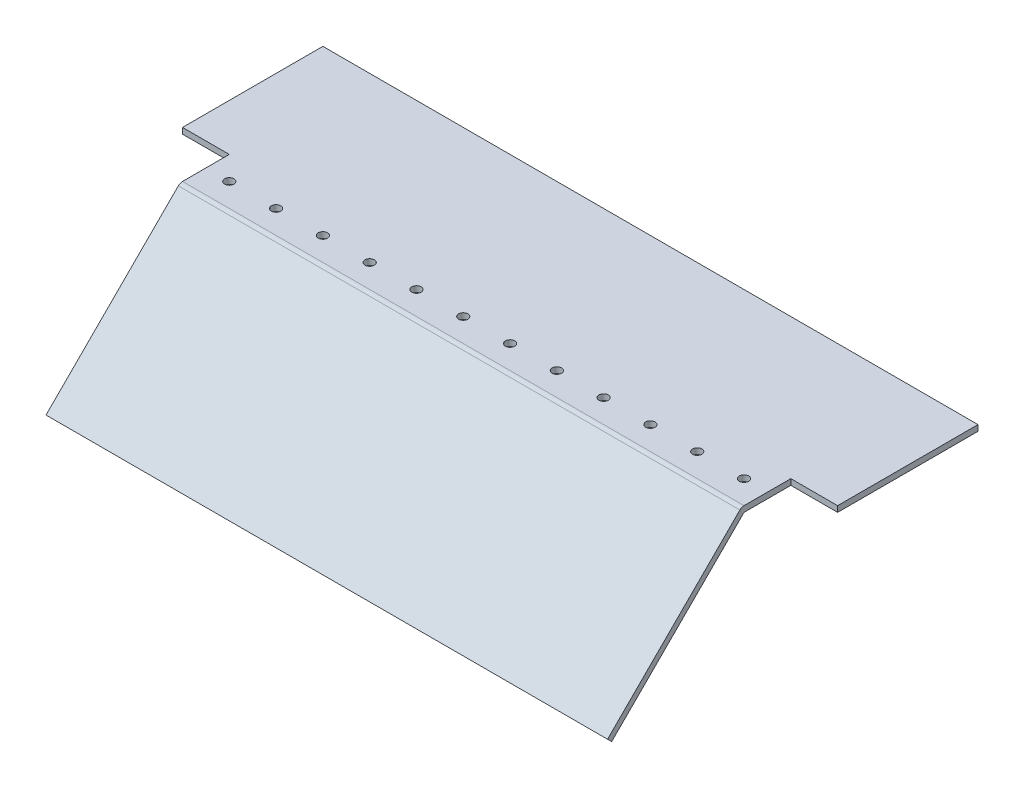
ISO-10303-21;
HEADER;
FILE_DESCRIPTION(('STEP AP214'),'2;1');
FILE_NAME('part.step','',(''),(''),'','','');
FILE_SCHEMA(('AUTOMOTIVE_DESIGN { 1 0 10303 214 1 1 1 1 }'));
ENDSEC;
DATA;
#1=APPLICATION_CONTEXT('core data for automotive mechanical design processes');
#2=APPLICATION_PROTOCOL_DEFINITION('international standard','automotive_design',2000,#1);
#3=PRODUCT_CONTEXT('',#1,'mechanical');
#4=PRODUCT('Part','Part','',(#3));
#5=PRODUCT_RELATED_PRODUCT_CATEGORY('part','',(#4));
#6=PRODUCT_DEFINITION_FORMATION('','',#4);
#7=PRODUCT_DEFINITION_CONTEXT('part definition',#1,'design');
#8=PRODUCT_DEFINITION('design','',#6,#7);
#9=PRODUCT_DEFINITION_SHAPE('','',#8);
#10=(LENGTH_UNIT() NAMED_UNIT(*) SI_UNIT(.MILLI.,.METRE.));
#11=(NAMED_UNIT(*) PLANE_ANGLE_UNIT() SI_UNIT($,.RADIAN.));
#12=(NAMED_UNIT(*) SI_UNIT($,.STERADIAN.) SOLID_ANGLE_UNIT());
#13=UNCERTAINTY_MEASURE_WITH_UNIT(LENGTH_MEASURE(1.E-05),#10,'distance_accuracy_value','');
#14=(GEOMETRIC_REPRESENTATION_CONTEXT(3) GLOBAL_UNCERTAINTY_ASSIGNED_CONTEXT((#13)) GLOBAL_UNIT_ASSIGNED_CONTEXT((#10,
#11,#12)) REPRESENTATION_CONTEXT('',''));
#15=CARTESIAN_POINT('',(0.,0.,0.));
#16=DIRECTION('',(0.,0.,1.));
#17=DIRECTION('',(1.,0.,0.));
#18=AXIS2_PLACEMENT_3D('',#15,#16,#17);
#19=CARTESIAN_POINT('',(139.7,-71.8420489685529,-12.7));
#20=DIRECTION('',(0.,1.,0.));
#21=DIRECTION('',(0.,0.,1.));
#22=AXIS2_PLACEMENT_3D('',#19,#20,#21);
#23=CYLINDRICAL_SURFACE('',#22,2.54000000000001);
#24=CARTESIAN_POINT('',(139.7,3.175,-12.7));
#25=DIRECTION('',(0.,1.,0.));
#26=DIRECTION('',(0.,0.,1.));
#27=AXIS2_PLACEMENT_3D('',#24,#25,#26);
#28=CIRCLE('',#27,2.54000000000001);
#29=CARTESIAN_POINT('',(139.7,3.175,-10.16));
#30=VERTEX_POINT('',#29);
#31=EDGE_CURVE('E50',#30,#30,#28,.T.);
#32=ORIENTED_EDGE('',*,*,#31,.T.);
#33=EDGE_LOOP('',(#32));
#34=FACE_BOUND('',#33,.T.);
#35=CARTESIAN_POINT('',(139.7,0.,-12.7));
#36=DIRECTION('',(0.,1.,0.));
#37=DIRECTION('',(0.,0.,1.));
#38=AXIS2_PLACEMENT_3D('',#35,#36,#37);
#39=CIRCLE('',#38,2.54000000000001);
#40=CARTESIAN_POINT('',(139.7,0.,-10.16));
#41=VERTEX_POINT('',#40);
#42=EDGE_CURVE('E11',#41,#41,#39,.T.);
#43=ORIENTED_EDGE('',*,*,#42,.F.);
#44=EDGE_LOOP('',(#43));
#45=FACE_BOUND('',#44,.T.);
#46=ADVANCED_FACE('F37',(#34,#45),#23,.F.);
#47=CARTESIAN_POINT('',(114.3,-71.8420489685529,-12.7));
#48=DIRECTION('',(0.,1.,0.));
#49=DIRECTION('',(0.,0.,1.));
#50=AXIS2_PLACEMENT_3D('',#47,#48,#49);
#51=CYLINDRICAL_SURFACE('',#50,2.54000000000001);
#52=CARTESIAN_POINT('',(114.3,3.175,-12.7));
#53=DIRECTION('',(0.,1.,0.));
#54=DIRECTION('',(0.,0.,1.));
#55=AXIS2_PLACEMENT_3D('',#52,#53,#54);
#56=CIRCLE('',#55,2.54000000000001);
#57=CARTESIAN_POINT('',(114.3,3.175,-10.16));
#58=VERTEX_POINT('',#57);
#59=EDGE_CURVE('E267',#58,#58,#56,.T.);
#60=ORIENTED_EDGE('',*,*,#59,.T.);
#61=EDGE_LOOP('',(#60));
#62=FACE_BOUND('',#61,.T.);
#63=CARTESIAN_POINT('',(114.3,0.,-12.7));
#64=DIRECTION('',(0.,1.,0.));
#65=DIRECTION('',(0.,0.,1.));
#66=AXIS2_PLACEMENT_3D('',#63,#64,#65);
#67=CIRCLE('',#66,2.54000000000001);
#68=CARTESIAN_POINT('',(114.3,0.,-10.16));
#69=VERTEX_POINT('',#68);
#70=EDGE_CURVE('E275',#69,#69,#67,.T.);
#71=ORIENTED_EDGE('',*,*,#70,.F.);
#72=EDGE_LOOP('',(#71));
#73=FACE_BOUND('',#72,.T.);
#74=ADVANCED_FACE('F296',(#62,#73),#51,.F.);
#75=CARTESIAN_POINT('',(88.9,-71.8420489685529,-12.7));
#76=DIRECTION('',(0.,1.,0.));
#77=DIRECTION('',(0.,0.,1.));
#78=AXIS2_PLACEMENT_3D('',#75,#76,#77);
#79=CYLINDRICAL_SURFACE('',#78,2.54000000000001);
#80=CARTESIAN_POINT('',(88.9,3.175,-12.7));
#81=DIRECTION('',(0.,1.,0.));
#82=DIRECTION('',(0.,0.,1.));
#83=AXIS2_PLACEMENT_3D('',#80,#81,#82);
#84=CIRCLE('',#83,2.54000000000001);
#85=CARTESIAN_POINT('',(88.9,3.175,-10.16));
#86=VERTEX_POINT('',#85);
#87=EDGE_CURVE('E263',#86,#86,#84,.T.);
#88=ORIENTED_EDGE('',*,*,#87,.T.);
#89=EDGE_LOOP('',(#88));
#90=FACE_BOUND('',#89,.T.);
#91=CARTESIAN_POINT('',(88.9,0.,-12.7));
#92=DIRECTION('',(0.,1.,0.));
#93=DIRECTION('',(0.,0.,1.));
#94=AXIS2_PLACEMENT_3D('',#91,#92,#93);
#95=CIRCLE('',#94,2.54000000000001);
#96=CARTESIAN_POINT('',(88.9,0.,-10.16));
#97=VERTEX_POINT('',#96);
#98=EDGE_CURVE('E266',#97,#97,#95,.T.);
#99=ORIENTED_EDGE('',*,*,#98,.F.);
#100=EDGE_LOOP('',(#99));
#101=FACE_BOUND('',#100,.T.);
#102=ADVANCED_FACE('F305',(#90,#101),#79,.F.);
#103=CARTESIAN_POINT('',(63.5,-71.8420489685529,-12.7));
#104=DIRECTION('',(0.,1.,0.));
#105=DIRECTION('',(0.,0.,1.));
#106=AXIS2_PLACEMENT_3D('',#103,#104,#105);
#107=CYLINDRICAL_SURFACE('',#106,2.54000000000001);
#108=CARTESIAN_POINT('',(63.5,3.175,-12.7));
#109=DIRECTION('',(0.,1.,0.));
#110=DIRECTION('',(0.,0.,1.));
#111=AXIS2_PLACEMENT_3D('',#108,#109,#110);
#112=CIRCLE('',#111,2.54000000000001);
#113=CARTESIAN_POINT('',(63.5,3.175,-10.16));
#114=VERTEX_POINT('',#113);
#115=EDGE_CURVE('E260',#114,#114,#112,.T.);
#116=ORIENTED_EDGE('',*,*,#115,.T.);
#117=EDGE_LOOP('',(#116));
#118=FACE_BOUND('',#117,.T.);
#119=CARTESIAN_POINT('',(63.5,0.,-12.7));
#120=DIRECTION('',(0.,1.,0.));
#121=DIRECTION('',(0.,0.,1.));
#122=AXIS2_PLACEMENT_3D('',#119,#120,#121);
#123=CIRCLE('',#122,2.54000000000001);
#124=CARTESIAN_POINT('',(63.5,0.,-10.16));
#125=VERTEX_POINT('',#124);
#126=EDGE_CURVE('E257',#125,#125,#123,.T.);
#127=ORIENTED_EDGE('',*,*,#126,.F.);
#128=EDGE_LOOP('',(#127));
#129=FACE_BOUND('',#128,.T.);
#130=ADVANCED_FACE('F306',(#118,#129),#107,.F.);
#131=CARTESIAN_POINT('',(38.1,-71.8420489685529,-12.7));
#132=DIRECTION('',(0.,1.,0.));
#133=DIRECTION('',(0.,0.,1.));
#134=AXIS2_PLACEMENT_3D('',#131,#132,#133);
#135=CYLINDRICAL_SURFACE('',#134,2.54000000000001);
#136=CARTESIAN_POINT('',(38.1,3.175,-12.7));
#137=DIRECTION('',(0.,1.,0.));
#138=DIRECTION('',(0.,0.,1.));
#139=AXIS2_PLACEMENT_3D('',#136,#137,#138);
#140=CIRCLE('',#139,2.54000000000001);
#141=CARTESIAN_POINT('',(38.1,3.175,-10.16));
#142=VERTEX_POINT('',#141);
#143=EDGE_CURVE('E253',#142,#142,#140,.T.);
#144=ORIENTED_EDGE('',*,*,#143,.T.);
#145=EDGE_LOOP('',(#144));
#146=FACE_BOUND('',#145,.T.);
#147=CARTESIAN_POINT('',(38.1,0.,-12.7));
#148=DIRECTION('',(0.,1.,0.));
#149=DIRECTION('',(0.,0.,1.));
#150=AXIS2_PLACEMENT_3D('',#147,#148,#149);
#151=CIRCLE('',#150,2.54000000000001);
#152=CARTESIAN_POINT('',(38.1,0.,-10.16));
#153=VERTEX_POINT('',#152);
#154=EDGE_CURVE('E255',#153,#153,#151,.T.);
#155=ORIENTED_EDGE('',*,*,#154,.F.);
#156=EDGE_LOOP('',(#155));
#157=FACE_BOUND('',#156,.T.);
#158=ADVANCED_FACE('F312',(#146,#157),#135,.F.);
#159=CARTESIAN_POINT('',(12.7,-71.8420489685529,-12.7));
#160=DIRECTION('',(0.,1.,0.));
#161=DIRECTION('',(0.,0.,1.));
#162=AXIS2_PLACEMENT_3D('',#159,#160,#161);
#163=CYLINDRICAL_SURFACE('',#162,2.54000000000001);
#164=CARTESIAN_POINT('',(12.7,3.175,-12.7));
#165=DIRECTION('',(0.,1.,0.));
#166=DIRECTION('',(0.,0.,1.));
#167=AXIS2_PLACEMENT_3D('',#164,#165,#166);
#168=CIRCLE('',#167,2.54000000000001);
#169=CARTESIAN_POINT('',(12.7,3.175,-10.16));
#170=VERTEX_POINT('',#169);
#171=EDGE_CURVE('E244',#170,#170,#168,.T.);
#172=ORIENTED_EDGE('',*,*,#171,.T.);
#173=EDGE_LOOP('',(#172));
#174=FACE_BOUND('',#173,.T.);
#175=CARTESIAN_POINT('',(12.7,0.,-12.7));
#176=DIRECTION('',(0.,1.,0.));
#177=DIRECTION('',(0.,0.,1.));
#178=AXIS2_PLACEMENT_3D('',#175,#176,#177);
#179=CIRCLE('',#178,2.54000000000001);
#180=CARTESIAN_POINT('',(12.7,0.,-10.16));
#181=VERTEX_POINT('',#180);
#182=EDGE_CURVE('E250',#181,#181,#179,.T.);
#183=ORIENTED_EDGE('',*,*,#182,.F.);
#184=EDGE_LOOP('',(#183));
#185=FACE_BOUND('',#184,.T.);
#186=ADVANCED_FACE('F317',(#174,#185),#163,.F.);
#187=CARTESIAN_POINT('',(-12.7,-71.8420489685529,-12.7));
#188=DIRECTION('',(0.,1.,0.));
#189=DIRECTION('',(0.,0.,1.));
#190=AXIS2_PLACEMENT_3D('',#187,#188,#189);
#191=CYLINDRICAL_SURFACE('',#190,2.54000000000001);
#192=CARTESIAN_POINT('',(-12.7,3.175,-12.7));
#193=DIRECTION('',(0.,1.,0.));
#194=DIRECTION('',(0.,0.,1.));
#195=AXIS2_PLACEMENT_3D('',#192,#193,#194);
#196=CIRCLE('',#195,2.54000000000001);
#197=CARTESIAN_POINT('',(-12.7,3.175,-10.16));
#198=VERTEX_POINT('',#197);
#199=EDGE_CURVE('E239',#198,#198,#196,.T.);
#200=ORIENTED_EDGE('',*,*,#199,.T.);
#201=EDGE_LOOP('',(#200));
#202=FACE_BOUND('',#201,.T.);
#203=CARTESIAN_POINT('',(-12.7,0.,-12.7));
#204=DIRECTION('',(0.,1.,0.));
#205=DIRECTION('',(0.,0.,1.));
#206=AXIS2_PLACEMENT_3D('',#203,#204,#205);
#207=CIRCLE('',#206,2.54000000000001);
#208=CARTESIAN_POINT('',(-12.7,0.,-10.16));
#209=VERTEX_POINT('',#208);
#210=EDGE_CURVE('E245',#209,#209,#207,.T.);
#211=ORIENTED_EDGE('',*,*,#210,.F.);
#212=EDGE_LOOP('',(#211));
#213=FACE_BOUND('',#212,.T.);
#214=ADVANCED_FACE('F323',(#202,#213),#191,.F.);
#215=CARTESIAN_POINT('',(-38.1,-71.8420489685529,-12.7));
#216=DIRECTION('',(0.,1.,0.));
#217=DIRECTION('',(0.,0.,1.));
#218=AXIS2_PLACEMENT_3D('',#215,#216,#217);
#219=CYLINDRICAL_SURFACE('',#218,2.54000000000001);
#220=CARTESIAN_POINT('',(-38.1,3.175,-12.7));
#221=DIRECTION('',(0.,1.,0.));
#222=DIRECTION('',(0.,0.,1.));
#223=AXIS2_PLACEMENT_3D('',#220,#221,#222);
#224=CIRCLE('',#223,2.54000000000001);
#225=CARTESIAN_POINT('',(-38.1,3.175,-10.16));
#226=VERTEX_POINT('',#225);
#227=EDGE_CURVE('E232',#226,#226,#224,.T.);
#228=ORIENTED_EDGE('',*,*,#227,.T.);
#229=EDGE_LOOP('',(#228));
#230=FACE_BOUND('',#229,.T.);
#231=CARTESIAN_POINT('',(-38.1,0.,-12.7));
#232=DIRECTION('',(0.,1.,0.));
#233=DIRECTION('',(0.,0.,1.));
#234=AXIS2_PLACEMENT_3D('',#231,#232,#233);
#235=CIRCLE('',#234,2.54000000000001);
#236=CARTESIAN_POINT('',(-38.1,0.,-10.16));
#237=VERTEX_POINT('',#236);
#238=EDGE_CURVE('E237',#237,#237,#235,.T.);
#239=ORIENTED_EDGE('',*,*,#238,.F.);
#240=EDGE_LOOP('',(#239));
#241=FACE_BOUND('',#240,.T.);
#242=ADVANCED_FACE('F330',(#230,#241),#219,.F.);
#243=CARTESIAN_POINT('',(-63.5,-71.8420489685529,-12.7));
#244=DIRECTION('',(0.,1.,0.));
#245=DIRECTION('',(0.,0.,1.));
#246=AXIS2_PLACEMENT_3D('',#243,#244,#245);
#247=CYLINDRICAL_SURFACE('',#246,2.54000000000001);
#248=CARTESIAN_POINT('',(-63.5,3.175,-12.7));
#249=DIRECTION('',(0.,1.,0.));
#250=DIRECTION('',(0.,0.,1.));
#251=AXIS2_PLACEMENT_3D('',#248,#249,#250);
#252=CIRCLE('',#251,2.54000000000001);
#253=CARTESIAN_POINT('',(-63.5,3.175,-10.16));
#254=VERTEX_POINT('',#253);
#255=EDGE_CURVE('E230',#254,#254,#252,.T.);
#256=ORIENTED_EDGE('',*,*,#255,.T.);
#257=EDGE_LOOP('',(#256));
#258=FACE_BOUND('',#257,.T.);
#259=CARTESIAN_POINT('',(-63.5,0.,-12.7));
#260=DIRECTION('',(0.,1.,0.));
#261=DIRECTION('',(0.,0.,1.));
#262=AXIS2_PLACEMENT_3D('',#259,#260,#261);
#263=CIRCLE('',#262,2.54000000000001);
#264=CARTESIAN_POINT('',(-63.5,0.,-10.16));
#265=VERTEX_POINT('',#264);
#266=EDGE_CURVE('E229',#265,#265,#263,.T.);
#267=ORIENTED_EDGE('',*,*,#266,.F.);
#268=EDGE_LOOP('',(#267));
#269=FACE_BOUND('',#268,.T.);
#270=ADVANCED_FACE('F332',(#258,#269),#247,.F.);
#271=CARTESIAN_POINT('',(-88.9,-71.8420489685529,-12.7));
#272=DIRECTION('',(0.,1.,0.));
#273=DIRECTION('',(0.,0.,1.));
#274=AXIS2_PLACEMENT_3D('',#271,#272,#273);
#275=CYLINDRICAL_SURFACE('',#274,2.54000000000001);
#276=CARTESIAN_POINT('',(-88.9,3.175,-12.7));
#277=DIRECTION('',(0.,1.,0.));
#278=DIRECTION('',(0.,0.,1.));
#279=AXIS2_PLACEMENT_3D('',#276,#277,#278);
#280=CIRCLE('',#279,2.54000000000001);
#281=CARTESIAN_POINT('',(-88.9,3.175,-10.16));
#282=VERTEX_POINT('',#281);
#283=EDGE_CURVE('E222',#282,#282,#280,.T.);
#284=ORIENTED_EDGE('',*,*,#283,.T.);
#285=EDGE_LOOP('',(#284));
#286=FACE_BOUND('',#285,.T.);
#287=CARTESIAN_POINT('',(-88.9,0.,-12.7));
#288=DIRECTION('',(0.,1.,0.));
#289=DIRECTION('',(0.,0.,1.));
#290=AXIS2_PLACEMENT_3D('',#287,#288,#289);
#291=CIRCLE('',#290,2.54000000000001);
#292=CARTESIAN_POINT('',(-88.9,0.,-10.16));
#293=VERTEX_POINT('',#292);
#294=EDGE_CURVE('E221',#293,#293,#291,.T.);
#295=ORIENTED_EDGE('',*,*,#294,.F.);
#296=EDGE_LOOP('',(#295));
#297=FACE_BOUND('',#296,.T.);
#298=ADVANCED_FACE('F333',(#286,#297),#275,.F.);
#299=CARTESIAN_POINT('',(152.4,0.,0.));
#300=DIRECTION('',(1.,0.,0.));
#301=DIRECTION('',(0.,0.,-1.));
#302=AXIS2_PLACEMENT_3D('',#299,#300,#301);
#303=PLANE('',#302);
#304=DIRECTION('',(0.,-0.707106781186544,0.707106781186551));
#305=VECTOR('',#304,1.);
#306=CARTESIAN_POINT('',(152.4,0.,0.));
#307=LINE('',#306,#305);
#308=CARTESIAN_POINT('',(152.4,0.,0.));
#309=VERTEX_POINT('',#308);
#310=CARTESIAN_POINT('',(152.4,-71.8420489685529,71.8420489685535));
#311=VERTEX_POINT('',#310);
#312=EDGE_CURVE('E187',#309,#311,#307,.T.);
#313=ORIENTED_EDGE('',*,*,#312,.F.);
#314=DIRECTION('',(0.,0.,1.));
#315=VECTOR('',#314,1.);
#316=CARTESIAN_POINT('',(152.4,0.,0.));
#317=LINE('',#316,#315);
#318=CARTESIAN_POINT('',(152.4,0.,-25.4));
#319=VERTEX_POINT('',#318);
#320=EDGE_CURVE('E168',#319,#309,#317,.T.);
#321=ORIENTED_EDGE('',*,*,#320,.F.);
#322=DIRECTION('',(0.,1.,0.));
#323=VECTOR('',#322,1.);
#324=CARTESIAN_POINT('',(152.4,-71.8420489685529,-25.4));
#325=LINE('',#324,#323);
#326=CARTESIAN_POINT('',(152.4,3.175,-25.4));
#327=VERTEX_POINT('',#326);
#328=EDGE_CURVE('E165',#319,#327,#325,.T.);
#329=ORIENTED_EDGE('',*,*,#328,.T.);
#330=DIRECTION('',(0.,0.,1.));
#331=VECTOR('',#330,1.);
#332=CARTESIAN_POINT('',(152.4,3.175,0.));
#333=LINE('',#332,#331);
#334=CARTESIAN_POINT('',(152.4,3.175,0.));
#335=VERTEX_POINT('',#334);
#336=EDGE_CURVE('E151',#327,#335,#333,.T.);
#337=ORIENTED_EDGE('',*,*,#336,.T.);
#338=CARTESIAN_POINT('',(152.4,0.,0.));
#339=DIRECTION('',(1.,0.,0.));
#340=DIRECTION('',(0.,0.,-1.));
#341=AXIS2_PLACEMENT_3D('',#338,#339,#340);
#342=CIRCLE('',#341,3.175);
#343=CARTESIAN_POINT('',(152.4,2.2450640302673,2.24506403026728));
#344=VERTEX_POINT('',#343);
#345=EDGE_CURVE('E194',#344,#335,#342,.F.);
#346=ORIENTED_EDGE('',*,*,#345,.F.);
#347=DIRECTION('',(0.,-0.707106781186545,0.70710678118655));
#348=VECTOR('',#347,1.);
#349=CARTESIAN_POINT('',(152.4,2.2450640302673,2.24506403026728));
#350=LINE('',#349,#348);
#351=CARTESIAN_POINT('',(152.4,-69.5969849382856,74.0871129988207));
#352=VERTEX_POINT('',#351);
#353=EDGE_CURVE('E193',#344,#352,#350,.T.);
#354=ORIENTED_EDGE('',*,*,#353,.T.);
#355=DIRECTION('',(0.,0.707106781186587,0.707106781186508));
#356=VECTOR('',#355,1.);
#357=CARTESIAN_POINT('',(152.4,-71.8420489685493,71.8420489685572));
#358=LINE('',#357,#356);
#359=EDGE_CURVE('E198',#311,#352,#358,.T.);
#360=ORIENTED_EDGE('',*,*,#359,.F.);
#361=EDGE_LOOP('',(#313,#321,#329,#337,#346,#354,#360));
#362=FACE_BOUND('',#361,.T.);
#363=ADVANCED_FACE('F337',(#362),#303,.T.);
#364=CARTESIAN_POINT('',(-152.4,0.,0.));
#365=DIRECTION('',(1.,0.,0.));
#366=DIRECTION('',(0.,0.,-1.));
#367=AXIS2_PLACEMENT_3D('',#364,#365,#366);
#368=PLANE('',#367);
#369=CARTESIAN_POINT('',(-152.4,0.,0.));
#370=DIRECTION('',(1.,0.,0.));
#371=DIRECTION('',(0.,0.,-1.));
#372=AXIS2_PLACEMENT_3D('',#369,#370,#371);
#373=CIRCLE('',#372,3.175);
#374=CARTESIAN_POINT('',(-152.4,2.2450640302673,2.24506403026728));
#375=VERTEX_POINT('',#374);
#376=CARTESIAN_POINT('',(-152.4,3.175,0.));
#377=VERTEX_POINT('',#376);
#378=EDGE_CURVE('E150',#375,#377,#373,.F.);
#379=ORIENTED_EDGE('',*,*,#378,.T.);
#380=DIRECTION('',(0.,0.,-1.));
#381=VECTOR('',#380,1.);
#382=CARTESIAN_POINT('',(-152.4,3.175,0.));
#383=LINE('',#382,#381);
#384=CARTESIAN_POINT('',(-152.4,3.175,-25.4));
#385=VERTEX_POINT('',#384);
#386=EDGE_CURVE('E145',#377,#385,#383,.T.);
#387=ORIENTED_EDGE('',*,*,#386,.T.);
#388=DIRECTION('',(0.,1.,0.));
#389=VECTOR('',#388,1.);
#390=CARTESIAN_POINT('',(-152.4,-71.8420489685529,-25.4));
#391=LINE('',#390,#389);
#392=CARTESIAN_POINT('',(-152.4,0.,-25.4));
#393=VERTEX_POINT('',#392);
#394=EDGE_CURVE('E133',#393,#385,#391,.T.);
#395=ORIENTED_EDGE('',*,*,#394,.F.);
#396=DIRECTION('',(0.,0.,-1.));
#397=VECTOR('',#396,1.);
#398=CARTESIAN_POINT('',(-152.4,0.,0.));
#399=LINE('',#398,#397);
#400=CARTESIAN_POINT('',(-152.4,0.,0.));
#401=VERTEX_POINT('',#400);
#402=EDGE_CURVE('E175',#401,#393,#399,.T.);
#403=ORIENTED_EDGE('',*,*,#402,.F.);
#404=DIRECTION('',(0.,-0.707106781186544,0.707106781186551));
#405=VECTOR('',#404,1.);
#406=CARTESIAN_POINT('',(-152.4,0.,0.));
#407=LINE('',#406,#405);
#408=CARTESIAN_POINT('',(-152.4,-71.8420489685529,71.8420489685535));
#409=VERTEX_POINT('',#408);
#410=EDGE_CURVE('E181',#401,#409,#407,.T.);
#411=ORIENTED_EDGE('',*,*,#410,.T.);
#412=DIRECTION('',(0.,0.707106781186587,0.707106781186508));
#413=VECTOR('',#412,1.);
#414=CARTESIAN_POINT('',(-152.4,-71.8420489685493,71.8420489685572));
#415=LINE('',#414,#413);
#416=CARTESIAN_POINT('',(-152.4,-69.5969849382856,74.0871129988207));
#417=VERTEX_POINT('',#416);
#418=EDGE_CURVE('E191',#409,#417,#415,.T.);
#419=ORIENTED_EDGE('',*,*,#418,.T.);
#420=DIRECTION('',(0.,-0.707106781186545,0.70710678118655));
#421=VECTOR('',#420,1.);
#422=CARTESIAN_POINT('',(-152.4,2.2450640302673,2.24506403026728));
#423=LINE('',#422,#421);
#424=EDGE_CURVE('E199',#375,#417,#423,.T.);
#425=ORIENTED_EDGE('',*,*,#424,.F.);
#426=EDGE_LOOP('',(#379,#387,#395,#403,#411,#419,#425));
#427=FACE_BOUND('',#426,.T.);
#428=ADVANCED_FACE('F144',(#427),#368,.F.);
#429=CARTESIAN_POINT('',(152.4,0.,0.));
#430=DIRECTION('',(0.,-0.707106781186551,-0.707106781186544));
#431=DIRECTION('',(0.,0.707106781186544,-0.707106781186551));
#432=AXIS2_PLACEMENT_3D('',#429,#430,#431);
#433=PLANE('',#432);
#434=ORIENTED_EDGE('',*,*,#410,.F.);
#435=DIRECTION('',(-1.,0.,0.));
#436=VECTOR('',#435,1.);
#437=CARTESIAN_POINT('',(152.4,0.,0.));
#438=LINE('',#437,#436);
#439=EDGE_CURVE('E216',#309,#401,#438,.T.);
#440=ORIENTED_EDGE('',*,*,#439,.F.);
#441=ORIENTED_EDGE('',*,*,#312,.T.);
#442=DIRECTION('',(-1.,0.,0.));
#443=VECTOR('',#442,1.);
#444=CARTESIAN_POINT('',(152.4,-71.8420489685529,71.8420489685535));
#445=LINE('',#444,#443);
#446=EDGE_CURVE('E61',#311,#409,#445,.T.);
#447=ORIENTED_EDGE('',*,*,#446,.T.);
#448=EDGE_LOOP('',(#434,#440,#441,#447));
#449=FACE_BOUND('',#448,.T.);
#450=ADVANCED_FACE('F341',(#449),#433,.T.);
#451=CARTESIAN_POINT('',(152.4,0.,0.));
#452=DIRECTION('',(0.,1.,0.));
#453=DIRECTION('',(0.,0.,1.));
#454=AXIS2_PLACEMENT_3D('',#451,#452,#453);
#455=PLANE('',#454);
#456=CARTESIAN_POINT('',(-114.3,0.,-12.7));
#457=DIRECTION('',(0.,1.,0.));
#458=DIRECTION('',(0.,0.,1.));
#459=AXIS2_PLACEMENT_3D('',#456,#457,#458);
#460=CIRCLE('',#459,2.54000000000001);
#461=CARTESIAN_POINT('',(-114.3,0.,-10.16));
#462=VERTEX_POINT('',#461);
#463=EDGE_CURVE('E348',#462,#462,#460,.T.);
#464=ORIENTED_EDGE('',*,*,#463,.T.);
#465=EDGE_LOOP('',(#464));
#466=FACE_BOUND('',#465,.T.);
#467=CARTESIAN_POINT('',(-139.7,0.,-12.7));
#468=DIRECTION('',(0.,1.,0.));
#469=DIRECTION('',(0.,0.,1.));
#470=AXIS2_PLACEMENT_3D('',#467,#468,#469);
#471=CIRCLE('',#470,2.54000000000001);
#472=CARTESIAN_POINT('',(-139.7,0.,-10.16));
#473=VERTEX_POINT('',#472);
#474=EDGE_CURVE('E164',#473,#473,#471,.T.);
#475=ORIENTED_EDGE('',*,*,#474,.T.);
#476=EDGE_LOOP('',(#475));
#477=FACE_BOUND('',#476,.T.);
#478=ORIENTED_EDGE('',*,*,#439,.T.);
#479=ORIENTED_EDGE('',*,*,#402,.T.);
#480=DIRECTION('',(-1.,0.,0.));
#481=VECTOR('',#480,1.);
#482=CARTESIAN_POINT('',(152.4,0.,-25.4));
#483=LINE('',#482,#481);
#484=CARTESIAN_POINT('',(-177.8,0.,-25.4));
#485=VERTEX_POINT('',#484);
#486=EDGE_CURVE('E140',#393,#485,#483,.T.);
#487=ORIENTED_EDGE('',*,*,#486,.T.);
#488=DIRECTION('',(0.,0.,-1.));
#489=VECTOR('',#488,1.);
#490=CARTESIAN_POINT('',(-177.8,0.,0.));
#491=LINE('',#490,#489);
#492=CARTESIAN_POINT('',(-177.8,0.,-101.6));
#493=VERTEX_POINT('',#492);
#494=EDGE_CURVE('E183',#485,#493,#491,.T.);
#495=ORIENTED_EDGE('',*,*,#494,.T.);
#496=DIRECTION('',(-1.,0.,0.));
#497=VECTOR('',#496,1.);
#498=CARTESIAN_POINT('',(152.4,0.,-101.6));
#499=LINE('',#498,#497);
#500=CARTESIAN_POINT('',(177.8,0.,-101.6));
#501=VERTEX_POINT('',#500);
#502=EDGE_CURVE('E213',#501,#493,#499,.T.);
#503=ORIENTED_EDGE('',*,*,#502,.F.);
#504=DIRECTION('',(0.,0.,-1.));
#505=VECTOR('',#504,1.);
#506=CARTESIAN_POINT('',(177.8,0.,0.));
#507=LINE('',#506,#505);
#508=CARTESIAN_POINT('',(177.8,0.,-25.4));
#509=VERTEX_POINT('',#508);
#510=EDGE_CURVE('E180',#509,#501,#507,.T.);
#511=ORIENTED_EDGE('',*,*,#510,.F.);
#512=DIRECTION('',(-1.,0.,0.));
#513=VECTOR('',#512,1.);
#514=CARTESIAN_POINT('',(152.4,0.,-25.4));
#515=LINE('',#514,#513);
#516=EDGE_CURVE('E53',#509,#319,#515,.T.);
#517=ORIENTED_EDGE('',*,*,#516,.T.);
#518=ORIENTED_EDGE('',*,*,#320,.T.);
#519=EDGE_LOOP('',(#478,#479,#487,#495,#503,#511,#517,#518));
#520=FACE_BOUND('',#519,.T.);
#521=ORIENTED_EDGE('',*,*,#294,.T.);
#522=EDGE_LOOP('',(#521));
#523=FACE_BOUND('',#522,.T.);
#524=ORIENTED_EDGE('',*,*,#266,.T.);
#525=EDGE_LOOP('',(#524));
#526=FACE_BOUND('',#525,.T.);
#527=ORIENTED_EDGE('',*,*,#238,.T.);
#528=EDGE_LOOP('',(#527));
#529=FACE_BOUND('',#528,.T.);
#530=ORIENTED_EDGE('',*,*,#210,.T.);
#531=EDGE_LOOP('',(#530));
#532=FACE_BOUND('',#531,.T.);
#533=ORIENTED_EDGE('',*,*,#182,.T.);
#534=EDGE_LOOP('',(#533));
#535=FACE_BOUND('',#534,.T.);
#536=ORIENTED_EDGE('',*,*,#154,.T.);
#537=EDGE_LOOP('',(#536));
#538=FACE_BOUND('',#537,.T.);
#539=ORIENTED_EDGE('',*,*,#126,.T.);
#540=EDGE_LOOP('',(#539));
#541=FACE_BOUND('',#540,.T.);
#542=ORIENTED_EDGE('',*,*,#98,.T.);
#543=EDGE_LOOP('',(#542));
#544=FACE_BOUND('',#543,.T.);
#545=ORIENTED_EDGE('',*,*,#70,.T.);
#546=EDGE_LOOP('',(#545));
#547=FACE_BOUND('',#546,.T.);
#548=ORIENTED_EDGE('',*,*,#42,.T.);
#549=EDGE_LOOP('',(#548));
#550=FACE_BOUND('',#549,.T.);
#551=ADVANCED_FACE('F295',(#466,#477,#520,#523,#526,#529,#532,#535,#538,#541,#544,#547,#550),
#455,.F.);
#552=CARTESIAN_POINT('',(152.4,0.,-101.6));
#553=DIRECTION('',(0.,0.,1.));
#554=DIRECTION('',(1.,0.,0.));
#555=AXIS2_PLACEMENT_3D('',#552,#553,#554);
#556=PLANE('',#555);
#557=ORIENTED_EDGE('',*,*,#502,.T.);
#558=DIRECTION('',(0.,1.,0.));
#559=VECTOR('',#558,1.);
#560=CARTESIAN_POINT('',(-177.8,0.,-101.6));
#561=LINE('',#560,#559);
#562=CARTESIAN_POINT('',(-177.8,3.175,-101.6));
#563=VERTEX_POINT('',#562);
#564=EDGE_CURVE('E177',#493,#563,#561,.T.);
#565=ORIENTED_EDGE('',*,*,#564,.T.);
#566=DIRECTION('',(-1.,0.,0.));
#567=VECTOR('',#566,1.);
#568=CARTESIAN_POINT('',(152.4,3.175,-101.6));
#569=LINE('',#568,#567);
#570=CARTESIAN_POINT('',(177.8,3.175,-101.6));
#571=VERTEX_POINT('',#570);
#572=EDGE_CURVE('E211',#571,#563,#569,.T.);
#573=ORIENTED_EDGE('',*,*,#572,.F.);
#574=DIRECTION('',(0.,1.,0.));
#575=VECTOR('',#574,1.);
#576=CARTESIAN_POINT('',(177.8,0.,-101.6));
#577=LINE('',#576,#575);
#578=EDGE_CURVE('E179',#501,#571,#577,.T.);
#579=ORIENTED_EDGE('',*,*,#578,.F.);
#580=EDGE_LOOP('',(#557,#565,#573,#579));
#581=FACE_BOUND('',#580,.T.);
#582=ADVANCED_FACE('F283',(#581),#556,.F.);
#583=CARTESIAN_POINT('',(152.4,3.175,0.));
#584=DIRECTION('',(0.,1.,0.));
#585=DIRECTION('',(0.,0.,1.));
#586=AXIS2_PLACEMENT_3D('',#583,#584,#585);
#587=PLANE('',#586);
#588=CARTESIAN_POINT('',(-114.3,3.175,-12.7));
#589=DIRECTION('',(0.,1.,0.));
#590=DIRECTION('',(0.,0.,1.));
#591=AXIS2_PLACEMENT_3D('',#588,#589,#590);
#592=CIRCLE('',#591,2.54000000000001);
#593=CARTESIAN_POINT('',(-114.3,3.175,-10.16));
#594=VERTEX_POINT('',#593);
#595=EDGE_CURVE('E583',#594,#594,#592,.T.);
#596=ORIENTED_EDGE('',*,*,#595,.F.);
#597=EDGE_LOOP('',(#596));
#598=FACE_BOUND('',#597,.T.);
#599=CARTESIAN_POINT('',(-139.7,3.175,-12.7));
#600=DIRECTION('',(0.,1.,0.));
#601=DIRECTION('',(0.,0.,1.));
#602=AXIS2_PLACEMENT_3D('',#599,#600,#601);
#603=CIRCLE('',#602,2.54000000000001);
#604=CARTESIAN_POINT('',(-139.7,3.175,-10.16));
#605=VERTEX_POINT('',#604);
#606=EDGE_CURVE('E582',#605,#605,#603,.T.);
#607=ORIENTED_EDGE('',*,*,#606,.F.);
#608=EDGE_LOOP('',(#607));
#609=FACE_BOUND('',#608,.T.);
#610=ORIENTED_EDGE('',*,*,#386,.F.);
#611=DIRECTION('',(-1.,0.,0.));
#612=VECTOR('',#611,1.);
#613=CARTESIAN_POINT('',(152.4,3.175,0.));
#614=LINE('',#613,#612);
#615=EDGE_CURVE('E207',#335,#377,#614,.T.);
#616=ORIENTED_EDGE('',*,*,#615,.F.);
#617=ORIENTED_EDGE('',*,*,#336,.F.);
#618=DIRECTION('',(-1.,0.,0.));
#619=VECTOR('',#618,1.);
#620=CARTESIAN_POINT('',(152.4,3.175,-25.4));
#621=LINE('',#620,#619);
#622=CARTESIAN_POINT('',(177.8,3.175,-25.4));
#623=VERTEX_POINT('',#622);
#624=EDGE_CURVE('E163',#623,#327,#621,.T.);
#625=ORIENTED_EDGE('',*,*,#624,.F.);
#626=DIRECTION('',(0.,0.,-1.));
#627=VECTOR('',#626,1.);
#628=CARTESIAN_POINT('',(177.8,3.175,0.));
#629=LINE('',#628,#627);
#630=EDGE_CURVE('E174',#623,#571,#629,.T.);
#631=ORIENTED_EDGE('',*,*,#630,.T.);
#632=ORIENTED_EDGE('',*,*,#572,.T.);
#633=DIRECTION('',(0.,0.,-1.));
#634=VECTOR('',#633,1.);
#635=CARTESIAN_POINT('',(-177.8,3.175,0.));
#636=LINE('',#635,#634);
#637=CARTESIAN_POINT('',(-177.8,3.175,-25.4));
#638=VERTEX_POINT('',#637);
#639=EDGE_CURVE('E160',#638,#563,#636,.T.);
#640=ORIENTED_EDGE('',*,*,#639,.F.);
#641=DIRECTION('',(-1.,0.,0.));
#642=VECTOR('',#641,1.);
#643=CARTESIAN_POINT('',(-152.4,3.175,-25.4));
#644=LINE('',#643,#642);
#645=EDGE_CURVE('E134',#385,#638,#644,.T.);
#646=ORIENTED_EDGE('',*,*,#645,.F.);
#647=EDGE_LOOP('',(#610,#616,#617,#625,#631,#632,#640,#646));
#648=FACE_BOUND('',#647,.T.);
#649=ORIENTED_EDGE('',*,*,#283,.F.);
#650=EDGE_LOOP('',(#649));
#651=FACE_BOUND('',#650,.T.);
#652=ORIENTED_EDGE('',*,*,#255,.F.);
#653=EDGE_LOOP('',(#652));
#654=FACE_BOUND('',#653,.T.);
#655=ORIENTED_EDGE('',*,*,#227,.F.);
#656=EDGE_LOOP('',(#655));
#657=FACE_BOUND('',#656,.T.);
#658=ORIENTED_EDGE('',*,*,#199,.F.);
#659=EDGE_LOOP('',(#658));
#660=FACE_BOUND('',#659,.T.);
#661=ORIENTED_EDGE('',*,*,#171,.F.);
#662=EDGE_LOOP('',(#661));
#663=FACE_BOUND('',#662,.T.);
#664=ORIENTED_EDGE('',*,*,#143,.F.);
#665=EDGE_LOOP('',(#664));
#666=FACE_BOUND('',#665,.T.);
#667=ORIENTED_EDGE('',*,*,#115,.F.);
#668=EDGE_LOOP('',(#667));
#669=FACE_BOUND('',#668,.T.);
#670=ORIENTED_EDGE('',*,*,#87,.F.);
#671=EDGE_LOOP('',(#670));
#672=FACE_BOUND('',#671,.T.);
#673=ORIENTED_EDGE('',*,*,#59,.F.);
#674=EDGE_LOOP('',(#673));
#675=FACE_BOUND('',#674,.T.);
#676=ORIENTED_EDGE('',*,*,#31,.F.);
#677=EDGE_LOOP('',(#676));
#678=FACE_BOUND('',#677,.T.);
#679=ADVANCED_FACE('F152',(#598,#609,#648,#651,#654,#657,#660,#663,#666,#669,#672,#675,#678),
#587,.T.);
#680=CARTESIAN_POINT('',(152.4,0.,0.));
#681=DIRECTION('',(-1.,0.,0.));
#682=DIRECTION('',(0.,0.,1.));
#683=AXIS2_PLACEMENT_3D('',#680,#681,#682);
#684=CYLINDRICAL_SURFACE('',#683,3.175);
#685=ORIENTED_EDGE('',*,*,#378,.F.);
#686=DIRECTION('',(-1.,0.,0.));
#687=VECTOR('',#686,1.);
#688=CARTESIAN_POINT('',(152.4,2.2450640302673,2.24506403026728));
#689=LINE('',#688,#687);
#690=EDGE_CURVE('E83',#344,#375,#689,.T.);
#691=ORIENTED_EDGE('',*,*,#690,.F.);
#692=ORIENTED_EDGE('',*,*,#345,.T.);
#693=ORIENTED_EDGE('',*,*,#615,.T.);
#694=EDGE_LOOP('',(#685,#691,#692,#693));
#695=FACE_BOUND('',#694,.T.);
#696=ADVANCED_FACE('F278',(#695),#684,.T.);
#697=CARTESIAN_POINT('',(152.4,2.2450640302673,2.24506403026728));
#698=DIRECTION('',(0.,-0.70710678118655,-0.707106781186545));
#699=DIRECTION('',(0.,0.707106781186545,-0.70710678118655));
#700=AXIS2_PLACEMENT_3D('',#697,#698,#699);
#701=PLANE('',#700);
#702=ORIENTED_EDGE('',*,*,#424,.T.);
#703=DIRECTION('',(-1.,0.,0.));
#704=VECTOR('',#703,1.);
#705=CARTESIAN_POINT('',(152.4,-69.5969849382856,74.0871129988207));
#706=LINE('',#705,#704);
#707=EDGE_CURVE('E206',#352,#417,#706,.T.);
#708=ORIENTED_EDGE('',*,*,#707,.F.);
#709=ORIENTED_EDGE('',*,*,#353,.F.);
#710=ORIENTED_EDGE('',*,*,#690,.T.);
#711=EDGE_LOOP('',(#702,#708,#709,#710));
#712=FACE_BOUND('',#711,.T.);
#713=ADVANCED_FACE('F288',(#712),#701,.F.);
#714=CARTESIAN_POINT('',(152.4,-71.8420489685493,71.8420489685572));
#715=DIRECTION('',(0.,-0.707106781186508,0.707106781186587));
#716=DIRECTION('',(0.,-0.707106781186587,-0.707106781186508));
#717=AXIS2_PLACEMENT_3D('',#714,#715,#716);
#718=PLANE('',#717);
#719=ORIENTED_EDGE('',*,*,#418,.F.);
#720=ORIENTED_EDGE('',*,*,#446,.F.);
#721=ORIENTED_EDGE('',*,*,#359,.T.);
#722=ORIENTED_EDGE('',*,*,#707,.T.);
#723=EDGE_LOOP('',(#719,#720,#721,#722));
#724=FACE_BOUND('',#723,.T.);
#725=ADVANCED_FACE('F383',(#724),#718,.T.);
#726=CARTESIAN_POINT('',(-177.8,0.,0.));
#727=DIRECTION('',(1.,0.,0.));
#728=DIRECTION('',(0.,0.,-1.));
#729=AXIS2_PLACEMENT_3D('',#726,#727,#728);
#730=PLANE('',#729);
#731=ORIENTED_EDGE('',*,*,#494,.F.);
#732=DIRECTION('',(0.,1.,0.));
#733=VECTOR('',#732,1.);
#734=CARTESIAN_POINT('',(-177.8,-71.8420489685529,-25.4));
#735=LINE('',#734,#733);
#736=EDGE_CURVE('E143',#485,#638,#735,.T.);
#737=ORIENTED_EDGE('',*,*,#736,.T.);
#738=ORIENTED_EDGE('',*,*,#639,.T.);
#739=ORIENTED_EDGE('',*,*,#564,.F.);
#740=EDGE_LOOP('',(#731,#737,#738,#739));
#741=FACE_BOUND('',#740,.T.);
#742=ADVANCED_FACE('F401',(#741),#730,.F.);
#743=CARTESIAN_POINT('',(177.8,0.,0.));
#744=DIRECTION('',(1.,0.,0.));
#745=DIRECTION('',(0.,0.,-1.));
#746=AXIS2_PLACEMENT_3D('',#743,#744,#745);
#747=PLANE('',#746);
#748=DIRECTION('',(0.,1.,0.));
#749=VECTOR('',#748,1.);
#750=CARTESIAN_POINT('',(177.8,0.,-25.4));
#751=LINE('',#750,#749);
#752=EDGE_CURVE('E218',#509,#623,#751,.T.);
#753=ORIENTED_EDGE('',*,*,#752,.F.);
#754=ORIENTED_EDGE('',*,*,#510,.T.);
#755=ORIENTED_EDGE('',*,*,#578,.T.);
#756=ORIENTED_EDGE('',*,*,#630,.F.);
#757=EDGE_LOOP('',(#753,#754,#755,#756));
#758=FACE_BOUND('',#757,.T.);
#759=ADVANCED_FACE('F396',(#758),#747,.T.);
#760=CARTESIAN_POINT('',(152.4,-71.8420489685529,-25.4));
#761=DIRECTION('',(0.,0.,-1.));
#762=DIRECTION('',(-1.,0.,0.));
#763=AXIS2_PLACEMENT_3D('',#760,#761,#762);
#764=PLANE('',#763);
#765=ORIENTED_EDGE('',*,*,#752,.T.);
#766=ORIENTED_EDGE('',*,*,#624,.T.);
#767=ORIENTED_EDGE('',*,*,#328,.F.);
#768=ORIENTED_EDGE('',*,*,#516,.F.);
#769=EDGE_LOOP('',(#765,#766,#767,#768));
#770=FACE_BOUND('',#769,.T.);
#771=ADVANCED_FACE('F391',(#770),#764,.F.);
#772=CARTESIAN_POINT('',(-152.4,-71.8420489685529,-25.4));
#773=DIRECTION('',(0.,0.,-1.));
#774=DIRECTION('',(-1.,0.,0.));
#775=AXIS2_PLACEMENT_3D('',#772,#773,#774);
#776=PLANE('',#775);
#777=ORIENTED_EDGE('',*,*,#394,.T.);
#778=ORIENTED_EDGE('',*,*,#645,.T.);
#779=ORIENTED_EDGE('',*,*,#736,.F.);
#780=ORIENTED_EDGE('',*,*,#486,.F.);
#781=EDGE_LOOP('',(#777,#778,#779,#780));
#782=FACE_BOUND('',#781,.T.);
#783=ADVANCED_FACE('F131',(#782),#776,.F.);
#784=CARTESIAN_POINT('',(-139.7,-71.8420489685529,-12.7));
#785=DIRECTION('',(0.,1.,0.));
#786=DIRECTION('',(0.,0.,1.));
#787=AXIS2_PLACEMENT_3D('',#784,#785,#786);
#788=CYLINDRICAL_SURFACE('',#787,2.54000000000001);
#789=ORIENTED_EDGE('',*,*,#606,.T.);
#790=EDGE_LOOP('',(#789));
#791=FACE_BOUND('',#790,.T.);
#792=ORIENTED_EDGE('',*,*,#474,.F.);
#793=EDGE_LOOP('',(#792));
#794=FACE_BOUND('',#793,.T.);
#795=ADVANCED_FACE('F502',(#791,#794),#788,.F.);
#796=CARTESIAN_POINT('',(-114.3,-71.8420489685529,-12.7));
#797=DIRECTION('',(0.,1.,0.));
#798=DIRECTION('',(0.,0.,1.));
#799=AXIS2_PLACEMENT_3D('',#796,#797,#798);
#800=CYLINDRICAL_SURFACE('',#799,2.54000000000001);
#801=ORIENTED_EDGE('',*,*,#595,.T.);
#802=EDGE_LOOP('',(#801));
#803=FACE_BOUND('',#802,.T.);
#804=ORIENTED_EDGE('',*,*,#463,.F.);
#805=EDGE_LOOP('',(#804));
#806=FACE_BOUND('',#805,.T.);
#807=ADVANCED_FACE('F512',(#803,#806),#800,.F.);
#808=CLOSED_SHELL('',(#46,#74,#102,#130,#158,#186,#214,#242,#270,#298,#363,#428,#450,#551,#582,
#679,#696,#713,#725,#742,#759,#771,#783,#795,#807));
#809=MANIFOLD_SOLID_BREP('B2',#808);
#810=ADVANCED_BREP_SHAPE_REPRESENTATION('',(#18,#809),#14);
#811=SHAPE_DEFINITION_REPRESENTATION(#9,#810);
ENDSEC;
END-ISO-10303-21;
